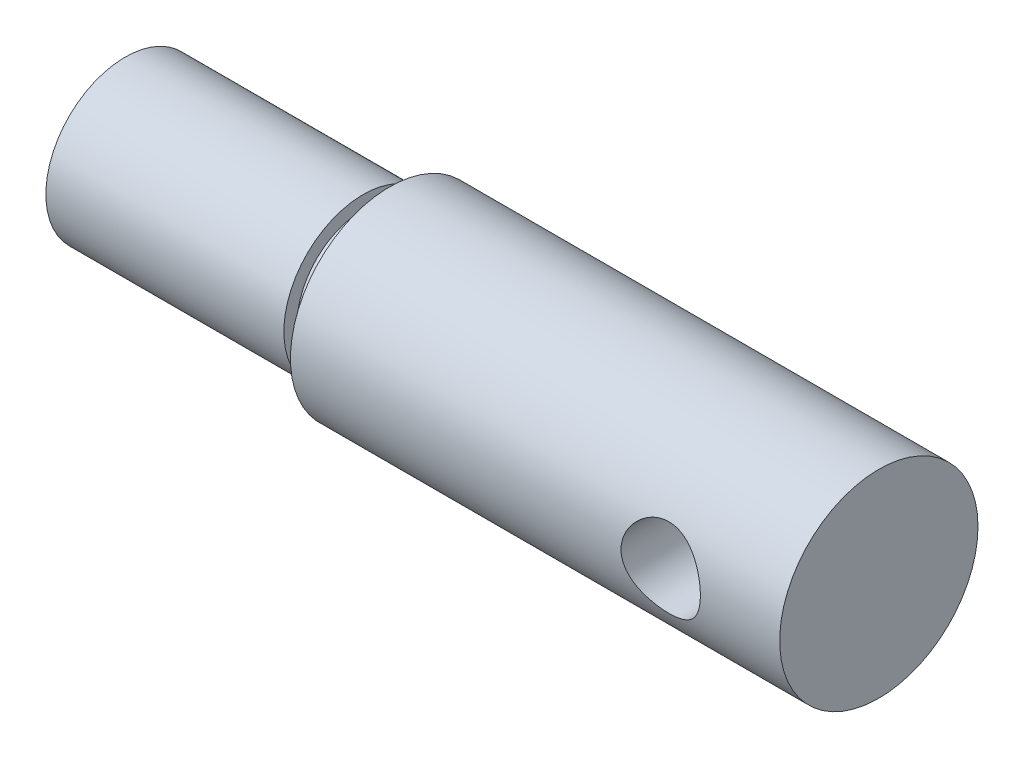
ISO-10303-21;
HEADER;
FILE_DESCRIPTION(('STEP AP214'),'2;1');
FILE_NAME('part.step','',(''),(''),'','','');
FILE_SCHEMA(('AUTOMOTIVE_DESIGN { 1 0 10303 214 1 1 1 1 }'));
ENDSEC;
DATA;
#1=APPLICATION_CONTEXT('core data for automotive mechanical design processes');
#2=APPLICATION_PROTOCOL_DEFINITION('international standard','automotive_design',2000,#1);
#3=PRODUCT_CONTEXT('',#1,'mechanical');
#4=PRODUCT('Part','Part','',(#3));
#5=PRODUCT_RELATED_PRODUCT_CATEGORY('part','',(#4));
#6=PRODUCT_DEFINITION_FORMATION('','',#4);
#7=PRODUCT_DEFINITION_CONTEXT('part definition',#1,'design');
#8=PRODUCT_DEFINITION('design','',#6,#7);
#9=PRODUCT_DEFINITION_SHAPE('','',#8);
#10=(LENGTH_UNIT() NAMED_UNIT(*) SI_UNIT(.MILLI.,.METRE.));
#11=(NAMED_UNIT(*) PLANE_ANGLE_UNIT() SI_UNIT($,.RADIAN.));
#12=(NAMED_UNIT(*) SI_UNIT($,.STERADIAN.) SOLID_ANGLE_UNIT());
#13=UNCERTAINTY_MEASURE_WITH_UNIT(LENGTH_MEASURE(1.E-05),#10,'distance_accuracy_value','');
#14=(GEOMETRIC_REPRESENTATION_CONTEXT(3) GLOBAL_UNCERTAINTY_ASSIGNED_CONTEXT((#13)) GLOBAL_UNIT_ASSIGNED_CONTEXT((#10,
#11,#12)) REPRESENTATION_CONTEXT('',''));
#15=CARTESIAN_POINT('',(0.,0.,0.));
#16=DIRECTION('',(0.,0.,1.));
#17=DIRECTION('',(1.,0.,0.));
#18=AXIS2_PLACEMENT_3D('',#15,#16,#17);
#19=CARTESIAN_POINT('',(57.,7.5,0.));
#20=DIRECTION('',(1.,0.,0.));
#21=DIRECTION('',(0.,0.,-1.));
#22=AXIS2_PLACEMENT_3D('',#19,#20,#21);
#23=PLANE('',#22);
#24=CARTESIAN_POINT('',(57.,0.,0.));
#25=DIRECTION('',(1.,0.,0.));
#26=DIRECTION('',(0.,0.,-1.));
#27=AXIS2_PLACEMENT_3D('',#24,#25,#26);
#28=CIRCLE('',#27,7.5);
#29=CARTESIAN_POINT('',(57.,0.,-7.5));
#30=VERTEX_POINT('',#29);
#31=EDGE_CURVE('E109',#30,#30,#28,.T.);
#32=ORIENTED_EDGE('',*,*,#31,.T.);
#33=EDGE_LOOP('',(#32));
#34=FACE_BOUND('',#33,.T.);
#35=ADVANCED_FACE('F43',(#34),#23,.T.);
#36=CARTESIAN_POINT('',(7.99999999999998,0.,0.));
#37=DIRECTION('',(0.,0.,1.));
#38=DIRECTION('',(1.,0.,0.));
#39=AXIS2_PLACEMENT_3D('',#36,#37,#38);
#40=SPHERICAL_SURFACE('',#39,9.99999999999998);
#41=CARTESIAN_POINT('',(7.99999999999998,0.,0.));
#42=DIRECTION('',(1.,0.,0.));
#43=DIRECTION('',(0.,0.,-1.));
#44=AXIS2_PLACEMENT_3D('',#41,#42,#43);
#45=SPHERICAL_SURFACE('',#44,9.99999999999998);
#46=CARTESIAN_POINT('',(0.,0.,0.));
#47=DIRECTION('',(1.,0.,0.));
#48=DIRECTION('',(0.,0.,-1.));
#49=AXIS2_PLACEMENT_3D('',#46,#47,#48);
#50=CIRCLE('',#49,5.99999999999999);
#51=CARTESIAN_POINT('',(0.,0.,-5.99999999999999));
#52=VERTEX_POINT('',#51);
#53=EDGE_CURVE('E47',#52,#52,#50,.T.);
#54=ORIENTED_EDGE('',*,*,#53,.F.);
#55=EDGE_LOOP('',(#54));
#56=FACE_BOUND('',#55,.T.);
#57=ADVANCED_FACE('F45',(#56),#45,.T.);
#58=CARTESIAN_POINT('',(57.,0.,0.));
#59=DIRECTION('',(1.,0.,0.));
#60=DIRECTION('',(0.,0.,-1.));
#61=AXIS2_PLACEMENT_3D('',#58,#59,#60);
#62=CYLINDRICAL_SURFACE('',#61,5.99999999999999);
#63=ORIENTED_EDGE('',*,*,#53,.T.);
#64=EDGE_LOOP('',(#63));
#65=FACE_BOUND('',#64,.T.);
#66=CARTESIAN_POINT('',(18.,0.,0.));
#67=DIRECTION('',(1.,0.,0.));
#68=DIRECTION('',(0.,0.,-1.));
#69=AXIS2_PLACEMENT_3D('',#66,#67,#68);
#70=CIRCLE('',#69,5.99999999999999);
#71=CARTESIAN_POINT('',(18.,0.,-5.99999999999999));
#72=VERTEX_POINT('',#71);
#73=EDGE_CURVE('E116',#72,#72,#70,.T.);
#74=ORIENTED_EDGE('',*,*,#73,.F.);
#75=EDGE_LOOP('',(#74));
#76=FACE_BOUND('',#75,.T.);
#77=ADVANCED_FACE('F83',(#65,#76),#62,.T.);
#78=CARTESIAN_POINT('',(18.,5.99999999999999,0.));
#79=DIRECTION('',(1.,0.,0.));
#80=DIRECTION('',(0.,0.,-1.));
#81=AXIS2_PLACEMENT_3D('',#78,#79,#80);
#82=PLANE('',#81);
#83=ORIENTED_EDGE('',*,*,#73,.T.);
#84=EDGE_LOOP('',(#83));
#85=FACE_BOUND('',#84,.T.);
#86=CARTESIAN_POINT('',(18.,0.,0.));
#87=DIRECTION('',(1.,0.,0.));
#88=DIRECTION('',(0.,0.,-1.));
#89=AXIS2_PLACEMENT_3D('',#86,#87,#88);
#90=CIRCLE('',#89,5.);
#91=CARTESIAN_POINT('',(18.,0.,-5.));
#92=VERTEX_POINT('',#91);
#93=EDGE_CURVE('E111',#92,#92,#90,.T.);
#94=ORIENTED_EDGE('',*,*,#93,.F.);
#95=EDGE_LOOP('',(#94));
#96=FACE_BOUND('',#95,.T.);
#97=ADVANCED_FACE('F89',(#85,#96),#82,.T.);
#98=CARTESIAN_POINT('',(57.,0.,0.));
#99=DIRECTION('',(1.,0.,0.));
#100=DIRECTION('',(0.,0.,-1.));
#101=AXIS2_PLACEMENT_3D('',#98,#99,#100);
#102=CYLINDRICAL_SURFACE('',#101,5.);
#103=ORIENTED_EDGE('',*,*,#93,.T.);
#104=EDGE_LOOP('',(#103));
#105=FACE_BOUND('',#104,.T.);
#106=CARTESIAN_POINT('',(20.,0.,0.));
#107=DIRECTION('',(1.,0.,0.));
#108=DIRECTION('',(0.,0.,-1.));
#109=AXIS2_PLACEMENT_3D('',#106,#107,#108);
#110=CIRCLE('',#109,4.99999999999999);
#111=CARTESIAN_POINT('',(20.,0.,-4.99999999999999));
#112=VERTEX_POINT('',#111);
#113=EDGE_CURVE('E104',#112,#112,#110,.T.);
#114=ORIENTED_EDGE('',*,*,#113,.F.);
#115=EDGE_LOOP('',(#114));
#116=FACE_BOUND('',#115,.T.);
#117=ADVANCED_FACE('F93',(#105,#116),#102,.T.);
#118=CARTESIAN_POINT('',(20.,4.99999999999999,0.));
#119=DIRECTION('',(-1.,0.,0.));
#120=DIRECTION('',(0.,0.,1.));
#121=AXIS2_PLACEMENT_3D('',#118,#119,#120);
#122=PLANE('',#121);
#123=ORIENTED_EDGE('',*,*,#113,.T.);
#124=EDGE_LOOP('',(#123));
#125=FACE_BOUND('',#124,.T.);
#126=CARTESIAN_POINT('',(20.,0.,0.));
#127=DIRECTION('',(1.,0.,0.));
#128=DIRECTION('',(0.,0.,-1.));
#129=AXIS2_PLACEMENT_3D('',#126,#127,#128);
#130=CIRCLE('',#129,7.5);
#131=CARTESIAN_POINT('',(20.,0.,-7.5));
#132=VERTEX_POINT('',#131);
#133=EDGE_CURVE('E107',#132,#132,#130,.T.);
#134=ORIENTED_EDGE('',*,*,#133,.F.);
#135=EDGE_LOOP('',(#134));
#136=FACE_BOUND('',#135,.T.);
#137=ADVANCED_FACE('F75',(#125,#136),#122,.T.);
#138=CARTESIAN_POINT('',(57.,0.,0.));
#139=DIRECTION('',(1.,0.,0.));
#140=DIRECTION('',(0.,0.,-1.));
#141=AXIS2_PLACEMENT_3D('',#138,#139,#140);
#142=CYLINDRICAL_SURFACE('',#141,7.5);
#143=CARTESIAN_POINT('',(51.,0.,-7.5));
#144=CARTESIAN_POINT('',(50.9999983890229,-0.0806632009395365,-7.49999888970472));
#145=CARTESIAN_POINT('',(50.99674011548,-0.161354413498373,-7.4986936895007));
#146=CARTESIAN_POINT('',(50.9837470954671,-0.322146094522254,-7.49351186176526));
#147=CARTESIAN_POINT('',(50.9740082625401,-0.402246157981983,-7.48963361174618));
#148=CARTESIAN_POINT('',(50.9351288598822,-0.641096781067453,-7.47424634808757));
#149=CARTESIAN_POINT('',(50.8963256924552,-0.798158082521719,-7.45898522266242));
#150=CARTESIAN_POINT('',(50.7946857721891,-1.10247033899881,-7.42011459126984));
#151=CARTESIAN_POINT('',(50.7319277009698,-1.24975157753076,-7.39653243529675));
#152=CARTESIAN_POINT('',(50.584471269705,-1.53159737405797,-7.34334877224069));
#153=CARTESIAN_POINT('',(50.4997805257342,-1.66616632427491,-7.31374935540466));
#154=CARTESIAN_POINT('',(50.3066467436976,-1.92525452632722,-7.24996340359365));
#155=CARTESIAN_POINT('',(50.1973400133687,-2.04909421803168,-7.2156344837394));
#156=CARTESIAN_POINT('',(49.9598999970569,-2.27726169757605,-7.14690862377684));
#157=CARTESIAN_POINT('',(49.8317575548035,-2.38157993941976,-7.11251165865921));
#158=CARTESIAN_POINT('',(49.5533578939879,-2.5723120820679,-7.04584188546733));
#159=CARTESIAN_POINT('',(49.4023702707912,-2.65772253361338,-7.01373174174385));
#160=CARTESIAN_POINT('',(49.0866954025439,-2.80163201676496,-6.95750470553338));
#161=CARTESIAN_POINT('',(48.9220147082749,-2.86014383023324,-6.93338401809297));
#162=CARTESIAN_POINT('',(48.5914314995666,-2.94584825055478,-6.8973953654561));
#163=CARTESIAN_POINT('',(48.4259231466171,-2.974340952837,-6.88502130539265));
#164=CARTESIAN_POINT('',(48.0920475025576,-3.00325943833355,-6.87246006067861));
#165=CARTESIAN_POINT('',(47.9236816580913,-3.00369902341367,-6.87226688315068));
#166=CARTESIAN_POINT('',(47.6013649927747,-2.97748405223856,-6.88365750391268));
#167=CARTESIAN_POINT('',(47.4472264282761,-2.95271297167583,-6.89442262441713));
#168=CARTESIAN_POINT('',(47.1455106658869,-2.87992032013237,-6.92514281294201));
#169=CARTESIAN_POINT('',(46.9979346178108,-2.83189469212407,-6.94509948450627));
#170=CARTESIAN_POINT('',(46.7099732457397,-2.71304209891513,-6.99239227665171));
#171=CARTESIAN_POINT('',(46.569796141427,-2.64176979349676,-7.01987068929879));
#172=CARTESIAN_POINT('',(46.3028762754486,-2.47875969107453,-7.07907174576133));
#173=CARTESIAN_POINT('',(46.1761385858933,-2.38701420764467,-7.1107959818286));
#174=CARTESIAN_POINT('',(45.9293854067997,-2.17732589918876,-7.17790105116004));
#175=CARTESIAN_POINT('',(45.8106469058317,-2.05790619445786,-7.21337497464924));
#176=CARTESIAN_POINT('',(45.5944732829962,-1.80047164114339,-7.28189737436726));
#177=CARTESIAN_POINT('',(45.4970424038844,-1.66245309800114,-7.31494536667799));
#178=CARTESIAN_POINT('',(45.3245738288765,-1.3681164789093,-7.37572021897015));
#179=CARTESIAN_POINT('',(45.2500165782045,-1.21149073701986,-7.40332905143173));
#180=CARTESIAN_POINT('',(45.1287482083829,-0.886535648224192,-7.44922242493087));
#181=CARTESIAN_POINT('',(45.0820229436639,-0.718212295274484,-7.4675117019356));
#182=CARTESIAN_POINT('',(45.0203275568705,-0.385343831411761,-7.49184209260378));
#183=CARTESIAN_POINT('',(45.0036413186197,-0.221164940978295,-7.49854418750274));
#184=CARTESIAN_POINT('',(44.9974303492071,0.107767964711716,-7.50102717765943));
#185=CARTESIAN_POINT('',(45.0078985776788,0.272521819835821,-7.49681090373437));
#186=CARTESIAN_POINT('',(45.054437628828,0.590149108683039,-7.4783635059563));
#187=CARTESIAN_POINT('',(45.0893369705264,0.743223737663436,-7.46459087018283));
#188=CARTESIAN_POINT('',(45.1821535624648,1.04120314209094,-7.42889162108252));
#189=CARTESIAN_POINT('',(45.2400737695033,1.18610686533642,-7.40696396034803));
#190=CARTESIAN_POINT('',(45.3791774095196,1.46861817872592,-7.3562489215621));
#191=CARTESIAN_POINT('',(45.4610182080636,1.60586703413639,-7.32727223969677));
#192=CARTESIAN_POINT('',(45.6449104858595,1.86516538686655,-7.26560047118315));
#193=CARTESIAN_POINT('',(45.746970064388,1.98720876112942,-7.23290389665512));
#194=CARTESIAN_POINT('',(45.9763050194201,2.22108456455631,-7.16467676457053));
#195=CARTESIAN_POINT('',(46.1048003122427,2.3317109007594,-7.12910162137139));
#196=CARTESIAN_POINT('',(46.3791601245307,2.53012679607026,-7.06112509376137));
#197=CARTESIAN_POINT('',(46.5250275005721,2.6179125918181,-7.02872423291408));
#198=CARTESIAN_POINT('',(46.8321925418284,2.76871125308742,-6.97071449859905));
#199=CARTESIAN_POINT('',(46.993625998583,2.83147589251401,-6.94517446320966));
#200=CARTESIAN_POINT('',(47.326100477808,2.92844432884615,-6.90485510223108));
#201=CARTESIAN_POINT('',(47.4971343095966,2.96266920524751,-6.89006783567176));
#202=CARTESIAN_POINT('',(47.830691851847,2.9995734283829,-6.87407638928379));
#203=CARTESIAN_POINT('',(47.9929422564508,3.00434563234764,-6.87197131434659));
#204=CARTESIAN_POINT('',(48.3158172895088,2.98770473002408,-6.87922254127235));
#205=CARTESIAN_POINT('',(48.4764421217941,2.96629494876878,-6.88857738776018));
#206=CARTESIAN_POINT('',(48.784998274275,2.89960708102334,-6.91689973341124));
#207=CARTESIAN_POINT('',(48.9331803731612,2.85530635681061,-6.93547246725062));
#208=CARTESIAN_POINT('',(49.2200679829191,2.7450080562502,-6.97986002865438));
#209=CARTESIAN_POINT('',(49.3587708638532,2.67900448789151,-7.00567685597585));
#210=CARTESIAN_POINT('',(49.6314142771862,2.52280960319953,-7.06347910401242));
#211=CARTESIAN_POINT('',(49.7646274239758,2.43144976133988,-7.09573308125317));
#212=CARTESIAN_POINT('',(50.014490557201,2.22883641977579,-7.16195721907533));
#213=CARTESIAN_POINT('',(50.1311355323133,2.11757692397659,-7.1959278947067));
#214=CARTESIAN_POINT('',(50.3523019648148,1.86976526416226,-7.26440289511609));
#215=CARTESIAN_POINT('',(50.4555470590559,1.73204093441049,-7.29879901943986));
#216=CARTESIAN_POINT('',(50.6375144693551,1.43982353523661,-7.36200845178942));
#217=CARTESIAN_POINT('',(50.7162253809562,1.28532271229705,-7.39081916114845));
#218=CARTESIAN_POINT('',(50.8130735008888,1.04589046292377,-7.42714827886078));
#219=CARTESIAN_POINT('',(50.841655970124,0.965550642326296,-7.438042523706));
#220=CARTESIAN_POINT('',(50.8919376582943,0.802472015195125,-7.45739623794253));
#221=CARTESIAN_POINT('',(50.9136400868448,0.71973434700378,-7.46585684248286));
#222=CARTESIAN_POINT('',(50.9498820309638,0.552707555877386,-7.48007543500346));
#223=CARTESIAN_POINT('',(50.9644397091379,0.468422937872987,-7.48584027408325));
#224=CARTESIAN_POINT('',(50.9863036527915,0.298814608941238,-7.49452509406316));
#225=CARTESIAN_POINT('',(50.9936150722507,0.213491680311735,-7.49744709693401));
#226=CARTESIAN_POINT('',(50.9990895204053,0.0853730051865981,-7.49963590220856));
#227=CARTESIAN_POINT('',(51.0000008525982,0.042690425593085,-7.50000058761588));
#228=CARTESIAN_POINT('',(51.,0.,-7.5));
#229=B_SPLINE_CURVE_WITH_KNOTS('',3,(#143,#144,#145,#146,#147,#148,#149,#150,#151,#152,#153,
#154,#155,#156,#157,#158,#159,#160,#161,#162,#163,#164,#165,#166,#167,#168,#169,#170,#171,#172,
#173,#174,#175,#176,#177,#178,#179,#180,#181,#182,#183,#184,#185,#186,#187,#188,#189,#190,#191,
#192,#193,#194,#195,#196,#197,#198,#199,#200,#201,#202,#203,#204,#205,#206,#207,#208,#209,#210,
#211,#212,#213,#214,#215,#216,#217,#218,#219,#220,#221,#222,#223,#224,#225,#226,#227,#228),
.UNSPECIFIED.,.T.,.F.,(4,2,2,2,2,2,2,2,2,2,2,2,2,2,2,2,2,2,2,2,2,2,2,2,2,2,2,2,2,2,2,2,2,2,2,2,
2,2,2,2,2,2,4),(0.,0.241952995066616,0.484058703589861,0.968979675762157,1.45232140795762,
1.93549552527002,2.43941494725621,2.94358014576642,3.47018310403851,3.99653556852428,
4.49901580138269,5.00124881685758,5.46852914780512,5.93589103065597,6.4127911162975,
6.88987055088801,7.40382945961361,7.91789061441125,8.44210791925735,8.96605856352212,
9.45899198973538,9.9517976253665,10.4224610552808,10.8931849567222,11.3783069227892,
11.8636236142998,12.3809813411815,12.8984242574715,13.4208798989277,13.9429493115043,
14.4274493227065,14.911887810261,15.3771690000468,15.8425787588927,16.3346362426657,
16.8268422420412,17.3509605748228,17.8753221764233,18.1329380344125,18.3904335342851,
18.6472710222664,18.9039257004316,19.0319776028183),.UNSPECIFIED.);
#230=CARTESIAN_POINT('',(51.,0.,-7.5));
#231=VERTEX_POINT('',#230);
#232=EDGE_CURVE('E10',#231,#231,#229,.T.);
#233=ORIENTED_EDGE('',*,*,#232,.F.);
#234=EDGE_LOOP('',(#233));
#235=FACE_BOUND('',#234,.T.);
#236=CARTESIAN_POINT('',(51.,0.,7.5));
#237=CARTESIAN_POINT('',(50.9999983890229,0.0806632009395357,7.49999888970472));
#238=CARTESIAN_POINT('',(50.99674011548,0.161354413498373,7.4986936895007));
#239=CARTESIAN_POINT('',(50.9837470954671,0.322146094522253,7.49351186176526));
#240=CARTESIAN_POINT('',(50.9740082625401,0.402246157981983,7.48963361174618));
#241=CARTESIAN_POINT('',(50.9351288598822,0.641096781067453,7.47424634808757));
#242=CARTESIAN_POINT('',(50.8963256924552,0.798158082521719,7.45898522266242));
#243=CARTESIAN_POINT('',(50.7946857721891,1.10247033899881,7.42011459126984));
#244=CARTESIAN_POINT('',(50.7319277009698,1.24975157753076,7.39653243529674));
#245=CARTESIAN_POINT('',(50.584471269705,1.53159737405797,7.34334877224069));
#246=CARTESIAN_POINT('',(50.4997805257342,1.66616632427491,7.31374935540466));
#247=CARTESIAN_POINT('',(50.3066467436976,1.92525452632722,7.24996340359365));
#248=CARTESIAN_POINT('',(50.1973400133687,2.04909421803168,7.21563448373939));
#249=CARTESIAN_POINT('',(49.9598999970569,2.27726169757605,7.14690862377684));
#250=CARTESIAN_POINT('',(49.8317575548035,2.38157993941976,7.11251165865921));
#251=CARTESIAN_POINT('',(49.5533578939878,2.5723120820679,7.04584188546733));
#252=CARTESIAN_POINT('',(49.4023702707912,2.65772253361338,7.01373174174385));
#253=CARTESIAN_POINT('',(49.0866954025439,2.80163201676496,6.95750470553338));
#254=CARTESIAN_POINT('',(48.9220147082749,2.86014383023324,6.93338401809297));
#255=CARTESIAN_POINT('',(48.5914314995666,2.94584825055478,6.8973953654561));
#256=CARTESIAN_POINT('',(48.4259231466171,2.974340952837,6.88502130539265));
#257=CARTESIAN_POINT('',(48.0920475025576,3.00325943833355,6.87246006067861));
#258=CARTESIAN_POINT('',(47.9236816580913,3.00369902341367,6.87226688315068));
#259=CARTESIAN_POINT('',(47.6013649927747,2.97748405223855,6.88365750391268));
#260=CARTESIAN_POINT('',(47.4472264282761,2.95271297167583,6.89442262441714));
#261=CARTESIAN_POINT('',(47.1455106658869,2.87992032013237,6.92514281294202));
#262=CARTESIAN_POINT('',(46.9979346178108,2.83189469212407,6.94509948450627));
#263=CARTESIAN_POINT('',(46.7099732457397,2.71304209891512,6.99239227665171));
#264=CARTESIAN_POINT('',(46.569796141427,2.64176979349676,7.01987068929879));
#265=CARTESIAN_POINT('',(46.3028762754486,2.47875969107453,7.07907174576133));
#266=CARTESIAN_POINT('',(46.1761385858933,2.38701420764467,7.11079598182861));
#267=CARTESIAN_POINT('',(45.9293854067997,2.17732589918875,7.17790105116005));
#268=CARTESIAN_POINT('',(45.8106469058317,2.05790619445785,7.21337497464924));
#269=CARTESIAN_POINT('',(45.5944732829962,1.80047164114338,7.28189737436726));
#270=CARTESIAN_POINT('',(45.4970424038844,1.66245309800113,7.31494536667799));
#271=CARTESIAN_POINT('',(45.3245738288764,1.36811647890928,7.37572021897015));
#272=CARTESIAN_POINT('',(45.2500165782045,1.21149073701985,7.40332905143173));
#273=CARTESIAN_POINT('',(45.1287482083829,0.88653564822418,7.44922242493087));
#274=CARTESIAN_POINT('',(45.0820229436639,0.718212295274476,7.4675117019356));
#275=CARTESIAN_POINT('',(45.0203275568705,0.385343831411757,7.49184209260378));
#276=CARTESIAN_POINT('',(45.0036413186197,0.221164940978291,7.49854418750274));
#277=CARTESIAN_POINT('',(44.9974303492071,-0.10776796471172,7.50102717765943));
#278=CARTESIAN_POINT('',(45.0078985776788,-0.272521819835825,7.49681090373437));
#279=CARTESIAN_POINT('',(45.054437628828,-0.590149108683044,7.4783635059563));
#280=CARTESIAN_POINT('',(45.0893369705264,-0.743223737663441,7.46459087018283));
#281=CARTESIAN_POINT('',(45.1821535624648,-1.04120314209095,7.42889162108252));
#282=CARTESIAN_POINT('',(45.2400737695033,-1.18610686533643,7.40696396034803));
#283=CARTESIAN_POINT('',(45.3791774095196,-1.46861817872592,7.3562489215621));
#284=CARTESIAN_POINT('',(45.4610182080636,-1.60586703413639,7.32727223969676));
#285=CARTESIAN_POINT('',(45.6449104858595,-1.86516538686655,7.26560047118315));
#286=CARTESIAN_POINT('',(45.746970064388,-1.98720876112943,7.23290389665512));
#287=CARTESIAN_POINT('',(45.9763050194201,-2.22108456455631,7.16467676457053));
#288=CARTESIAN_POINT('',(46.1048003122427,-2.3317109007594,7.12910162137139));
#289=CARTESIAN_POINT('',(46.3791601245307,-2.53012679607027,7.06112509376137));
#290=CARTESIAN_POINT('',(46.5250275005721,-2.61791259181811,7.02872423291408));
#291=CARTESIAN_POINT('',(46.8321925418284,-2.76871125308743,6.97071449859905));
#292=CARTESIAN_POINT('',(46.993625998583,-2.83147589251401,6.94517446320966));
#293=CARTESIAN_POINT('',(47.326100477808,-2.92844432884615,6.90485510223108));
#294=CARTESIAN_POINT('',(47.4971343095966,-2.96266920524751,6.89006783567176));
#295=CARTESIAN_POINT('',(47.830691851847,-2.9995734283829,6.87407638928379));
#296=CARTESIAN_POINT('',(47.9929422564508,-3.00434563234764,6.87197131434659));
#297=CARTESIAN_POINT('',(48.3158172895088,-2.98770473002408,6.87922254127235));
#298=CARTESIAN_POINT('',(48.4764421217941,-2.96629494876878,6.88857738776018));
#299=CARTESIAN_POINT('',(48.784998274275,-2.89960708102335,6.91689973341124));
#300=CARTESIAN_POINT('',(48.9331803731612,-2.85530635681061,6.93547246725061));
#301=CARTESIAN_POINT('',(49.2200679829191,-2.7450080562502,6.97986002865438));
#302=CARTESIAN_POINT('',(49.3587708638532,-2.67900448789151,7.00567685597585));
#303=CARTESIAN_POINT('',(49.6314142771862,-2.52280960319953,7.06347910401242));
#304=CARTESIAN_POINT('',(49.7646274239758,-2.43144976133989,7.09573308125317));
#305=CARTESIAN_POINT('',(50.014490557201,-2.2288364197758,7.16195721907533));
#306=CARTESIAN_POINT('',(50.1311355323133,-2.1175769239766,7.1959278947067));
#307=CARTESIAN_POINT('',(50.3523019648148,-1.86976526416226,7.26440289511609));
#308=CARTESIAN_POINT('',(50.455547059056,-1.73204093441049,7.29879901943986));
#309=CARTESIAN_POINT('',(50.6375144693551,-1.43982353523661,7.36200845178942));
#310=CARTESIAN_POINT('',(50.7162253809562,-1.28532271229705,7.39081916114846));
#311=CARTESIAN_POINT('',(50.8130735008888,-1.04589046292377,7.42714827886078));
#312=CARTESIAN_POINT('',(50.841655970124,-0.965550642326298,7.438042523706));
#313=CARTESIAN_POINT('',(50.8919376582943,-0.802472015195127,7.45739623794253));
#314=CARTESIAN_POINT('',(50.9136400868448,-0.719734347003782,7.46585684248286));
#315=CARTESIAN_POINT('',(50.9498820309638,-0.552707555877387,7.48007543500346));
#316=CARTESIAN_POINT('',(50.9644397091379,-0.468422937872988,7.48584027408325));
#317=CARTESIAN_POINT('',(50.9863036527915,-0.298814608941239,7.49452509406316));
#318=CARTESIAN_POINT('',(50.9936150722507,-0.213491680311736,7.49744709693401));
#319=CARTESIAN_POINT('',(50.9990895204053,-0.0853730051865994,7.49963590220856));
#320=CARTESIAN_POINT('',(51.0000008525982,-0.0426904255930861,7.50000058761588));
#321=CARTESIAN_POINT('',(51.,0.,7.5));
#322=B_SPLINE_CURVE_WITH_KNOTS('',3,(#236,#237,#238,#239,#240,#241,#242,#243,#244,#245,#246,
#247,#248,#249,#250,#251,#252,#253,#254,#255,#256,#257,#258,#259,#260,#261,#262,#263,#264,#265,
#266,#267,#268,#269,#270,#271,#272,#273,#274,#275,#276,#277,#278,#279,#280,#281,#282,#283,#284,
#285,#286,#287,#288,#289,#290,#291,#292,#293,#294,#295,#296,#297,#298,#299,#300,#301,#302,#303,
#304,#305,#306,#307,#308,#309,#310,#311,#312,#313,#314,#315,#316,#317,#318,#319,#320,#321),
.UNSPECIFIED.,.T.,.F.,(4,2,2,2,2,2,2,2,2,2,2,2,2,2,2,2,2,2,2,2,2,2,2,2,2,2,2,2,2,2,2,2,2,2,2,2,
2,2,2,2,2,2,4),(0.,0.241952995066616,0.484058703589861,0.968979675762158,1.45232140795763,
1.93549552527002,2.43941494725621,2.94358014576643,3.47018310403851,3.99653556852428,
4.49901580138269,5.00124881685758,5.46852914780512,5.93589103065597,6.4127911162975,
6.88987055088802,7.40382945961362,7.91789061441126,8.44210791925736,8.96605856352212,
9.45899198973538,9.9517976253665,10.4224610552808,10.8931849567222,11.3783069227892,
11.8636236142998,12.3809813411815,12.8984242574715,13.4208798989277,13.9429493115043,
14.4274493227065,14.911887810261,15.3771690000468,15.8425787588927,16.3346362426657,
16.8268422420412,17.3509605748228,17.8753221764233,18.1329380344125,18.3904335342851,
18.6472710222664,18.9039257004316,19.0319776028184),.UNSPECIFIED.);
#323=CARTESIAN_POINT('',(51.,0.,7.5));
#324=VERTEX_POINT('',#323);
#325=EDGE_CURVE('E51',#324,#324,#322,.T.);
#326=ORIENTED_EDGE('',*,*,#325,.F.);
#327=EDGE_LOOP('',(#326));
#328=FACE_BOUND('',#327,.T.);
#329=ORIENTED_EDGE('',*,*,#133,.T.);
#330=EDGE_LOOP('',(#329));
#331=FACE_BOUND('',#330,.T.);
#332=ORIENTED_EDGE('',*,*,#31,.F.);
#333=EDGE_LOOP('',(#332));
#334=FACE_BOUND('',#333,.T.);
#335=ADVANCED_FACE('F65',(#235,#328,#331,#334),#142,.T.);
#336=CARTESIAN_POINT('',(48.,0.,-7.5));
#337=DIRECTION('',(0.,0.,1.));
#338=DIRECTION('',(1.,0.,0.));
#339=AXIS2_PLACEMENT_3D('',#336,#337,#338);
#340=CYLINDRICAL_SURFACE('',#339,3.);
#341=ORIENTED_EDGE('',*,*,#232,.T.);
#342=EDGE_LOOP('',(#341));
#343=FACE_BOUND('',#342,.T.);
#344=ORIENTED_EDGE('',*,*,#325,.T.);
#345=EDGE_LOOP('',(#344));
#346=FACE_BOUND('',#345,.T.);
#347=ADVANCED_FACE('F68',(#343,#346),#340,.F.);
#348=CLOSED_SHELL('',(#35,#57,#77,#97,#117,#137,#335,#347));
#349=MANIFOLD_SOLID_BREP('B2',#348);
#350=ADVANCED_BREP_SHAPE_REPRESENTATION('',(#18,#349),#14);
#351=SHAPE_DEFINITION_REPRESENTATION(#9,#350);
ENDSEC;
END-ISO-10303-21;
